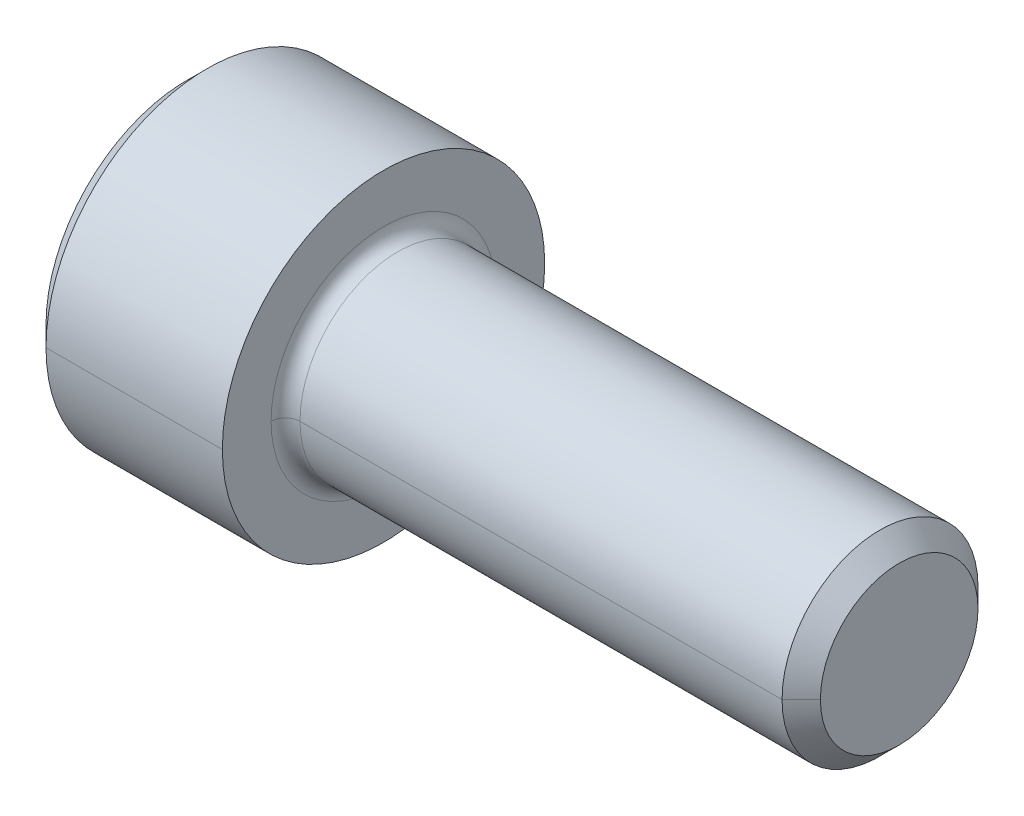
ISO-10303-21;
HEADER;
FILE_DESCRIPTION(('STEP AP214'),'2;1');
FILE_NAME('part.step','',(''),(''),'','','');
FILE_SCHEMA(('AUTOMOTIVE_DESIGN { 1 0 10303 214 1 1 1 1 }'));
ENDSEC;
DATA;
#1=APPLICATION_CONTEXT('core data for automotive mechanical design processes');
#2=APPLICATION_PROTOCOL_DEFINITION('international standard','automotive_design',2000,#1);
#3=PRODUCT_CONTEXT('',#1,'mechanical');
#4=PRODUCT('Part','Part','',(#3));
#5=PRODUCT_RELATED_PRODUCT_CATEGORY('part','',(#4));
#6=PRODUCT_DEFINITION_FORMATION('','',#4);
#7=PRODUCT_DEFINITION_CONTEXT('part definition',#1,'design');
#8=PRODUCT_DEFINITION('design','',#6,#7);
#9=PRODUCT_DEFINITION_SHAPE('','',#8);
#10=(LENGTH_UNIT() NAMED_UNIT(*) SI_UNIT(.MILLI.,.METRE.));
#11=(NAMED_UNIT(*) PLANE_ANGLE_UNIT() SI_UNIT($,.RADIAN.));
#12=(NAMED_UNIT(*) SI_UNIT($,.STERADIAN.) SOLID_ANGLE_UNIT());
#13=UNCERTAINTY_MEASURE_WITH_UNIT(LENGTH_MEASURE(1.E-05),#10,'distance_accuracy_value','');
#14=(GEOMETRIC_REPRESENTATION_CONTEXT(3) GLOBAL_UNCERTAINTY_ASSIGNED_CONTEXT((#13)) GLOBAL_UNIT_ASSIGNED_CONTEXT((#10,
#11,#12)) REPRESENTATION_CONTEXT('',''));
#15=CARTESIAN_POINT('',(0.,0.,0.));
#16=DIRECTION('',(0.,0.,1.));
#17=DIRECTION('',(1.,0.,0.));
#18=AXIS2_PLACEMENT_3D('',#15,#16,#17);
#19=CARTESIAN_POINT('',(2.286,0.,0.));
#20=DIRECTION('',(-1.,0.,0.));
#21=DIRECTION('',(0.,0.,1.));
#22=AXIS2_PLACEMENT_3D('',#19,#20,#21);
#23=CONICAL_SURFACE('',#22,1.98501,1.0471975511966);
#24=DIRECTION('',(-0.5,0.,-0.866025403784437));
#25=VECTOR('',#24,1.);
#26=CARTESIAN_POINT('',(2.286,0.,-1.98501));
#27=LINE('',#26,#25);
#28=CARTESIAN_POINT('',(3.43204605784411,0.,0.));
#29=VERTEX_POINT('',#28);
#30=CARTESIAN_POINT('',(2.286,0.,-1.98501));
#31=VERTEX_POINT('',#30);
#32=EDGE_CURVE('E293',#29,#31,#27,.T.);
#33=ORIENTED_EDGE('',*,*,#32,.F.);
#34=DIRECTION('',(-0.5,0.,0.866025403784437));
#35=VECTOR('',#34,1.);
#36=CARTESIAN_POINT('',(2.286,0.,1.98501));
#37=LINE('',#36,#35);
#38=CARTESIAN_POINT('',(2.286,0.,1.98501));
#39=VERTEX_POINT('',#38);
#40=EDGE_CURVE('E298',#29,#39,#37,.T.);
#41=ORIENTED_EDGE('',*,*,#40,.T.);
#42=CARTESIAN_POINT('',(2.286,0.,0.));
#43=DIRECTION('',(-1.,0.,0.));
#44=DIRECTION('',(0.,0.,1.));
#45=AXIS2_PLACEMENT_3D('',#42,#43,#44);
#46=CIRCLE('',#45,1.98501);
#47=CARTESIAN_POINT('',(2.286,1.71906908676615,0.992505));
#48=VERTEX_POINT('',#47);
#49=EDGE_CURVE('E11',#39,#48,#46,.T.);
#50=ORIENTED_EDGE('',*,*,#49,.T.);
#51=CARTESIAN_POINT('',(2.286,0.,0.));
#52=DIRECTION('',(-1.,0.,0.));
#53=DIRECTION('',(0.,0.,1.));
#54=AXIS2_PLACEMENT_3D('',#51,#52,#53);
#55=CIRCLE('',#54,1.98501);
#56=CARTESIAN_POINT('',(2.286,1.71906908676615,-0.992505));
#57=VERTEX_POINT('',#56);
#58=EDGE_CURVE('E28',#48,#57,#55,.T.);
#59=ORIENTED_EDGE('',*,*,#58,.T.);
#60=CARTESIAN_POINT('',(2.286,0.,0.));
#61=DIRECTION('',(-1.,0.,0.));
#62=DIRECTION('',(0.,0.,1.));
#63=AXIS2_PLACEMENT_3D('',#60,#61,#62);
#64=CIRCLE('',#63,1.98501);
#65=EDGE_CURVE('E337',#57,#31,#64,.T.);
#66=ORIENTED_EDGE('',*,*,#65,.T.);
#67=EDGE_LOOP('',(#33,#41,#50,#59,#66));
#68=FACE_BOUND('',#67,.T.);
#69=ADVANCED_FACE('F17',(#68),#23,.F.);
#70=CARTESIAN_POINT('',(2.286,1.14604605784411,1.98501));
#71=DIRECTION('',(-1.,0.,0.));
#72=DIRECTION('',(0.,0.,1.));
#73=AXIS2_PLACEMENT_3D('',#70,#71,#72);
#74=PLANE('',#73);
#75=ORIENTED_EDGE('',*,*,#49,.F.);
#76=DIRECTION('',(0.,1.,0.));
#77=VECTOR('',#76,1.);
#78=CARTESIAN_POINT('',(2.286,-1.14604605784409,1.98501));
#79=LINE('',#78,#77);
#80=CARTESIAN_POINT('',(2.286,1.14604605784411,1.98501));
#81=VERTEX_POINT('',#80);
#82=EDGE_CURVE('E253',#39,#81,#79,.T.);
#83=ORIENTED_EDGE('',*,*,#82,.T.);
#84=DIRECTION('',(0.,-0.5,0.86602540378444));
#85=VECTOR('',#84,1.);
#86=CARTESIAN_POINT('',(2.286,2.29209211568821,0.));
#87=LINE('',#86,#85);
#88=EDGE_CURVE('E254',#48,#81,#87,.T.);
#89=ORIENTED_EDGE('',*,*,#88,.F.);
#90=EDGE_LOOP('',(#75,#83,#89));
#91=FACE_BOUND('',#90,.T.);
#92=ADVANCED_FACE('F439',(#91),#74,.T.);
#93=CARTESIAN_POINT('',(2.286,1.14604605784411,1.98501));
#94=DIRECTION('',(-1.,0.,0.));
#95=DIRECTION('',(0.,0.,1.));
#96=AXIS2_PLACEMENT_3D('',#93,#94,#95);
#97=PLANE('',#96);
#98=ORIENTED_EDGE('',*,*,#58,.F.);
#99=DIRECTION('',(0.,-0.5,0.86602540378444));
#100=VECTOR('',#99,1.);
#101=CARTESIAN_POINT('',(2.286,2.29209211568821,0.));
#102=LINE('',#101,#100);
#103=CARTESIAN_POINT('',(2.286,2.29209211568821,0.));
#104=VERTEX_POINT('',#103);
#105=EDGE_CURVE('E192',#104,#48,#102,.T.);
#106=ORIENTED_EDGE('',*,*,#105,.F.);
#107=DIRECTION('',(0.,-0.5,-0.866025403784438));
#108=VECTOR('',#107,1.);
#109=CARTESIAN_POINT('',(2.286,2.29209211568821,0.));
#110=LINE('',#109,#108);
#111=EDGE_CURVE('E186',#104,#57,#110,.T.);
#112=ORIENTED_EDGE('',*,*,#111,.T.);
#113=EDGE_LOOP('',(#98,#106,#112));
#114=FACE_BOUND('',#113,.T.);
#115=ADVANCED_FACE('F444',(#114),#97,.T.);
#116=CARTESIAN_POINT('',(2.286,1.14604605784411,1.98501));
#117=DIRECTION('',(-1.,0.,0.));
#118=DIRECTION('',(0.,0.,1.));
#119=AXIS2_PLACEMENT_3D('',#116,#117,#118);
#120=PLANE('',#119);
#121=ORIENTED_EDGE('',*,*,#65,.F.);
#122=DIRECTION('',(0.,-0.5,-0.866025403784438));
#123=VECTOR('',#122,1.);
#124=CARTESIAN_POINT('',(2.286,2.29209211568821,0.));
#125=LINE('',#124,#123);
#126=CARTESIAN_POINT('',(2.286,1.1460460578441,-1.98501));
#127=VERTEX_POINT('',#126);
#128=EDGE_CURVE('E236',#57,#127,#125,.T.);
#129=ORIENTED_EDGE('',*,*,#128,.T.);
#130=DIRECTION('',(0.,-1.,0.));
#131=VECTOR('',#130,1.);
#132=CARTESIAN_POINT('',(2.286,1.1460460578441,-1.98501));
#133=LINE('',#132,#131);
#134=EDGE_CURVE('E279',#127,#31,#133,.T.);
#135=ORIENTED_EDGE('',*,*,#134,.T.);
#136=EDGE_LOOP('',(#121,#129,#135));
#137=FACE_BOUND('',#136,.T.);
#138=ADVANCED_FACE('F453',(#137),#120,.T.);
#139=CARTESIAN_POINT('',(2.286,1.14604605784411,1.98501));
#140=DIRECTION('',(-1.,0.,0.));
#141=DIRECTION('',(0.,0.,1.));
#142=AXIS2_PLACEMENT_3D('',#139,#140,#141);
#143=PLANE('',#142);
#144=CARTESIAN_POINT('',(2.286,0.,0.));
#145=DIRECTION('',(-1.,0.,0.));
#146=DIRECTION('',(0.,0.,1.));
#147=AXIS2_PLACEMENT_3D('',#144,#145,#146);
#148=CIRCLE('',#147,1.98501);
#149=CARTESIAN_POINT('',(2.286,-1.71906908676615,-0.992505));
#150=VERTEX_POINT('',#149);
#151=EDGE_CURVE('E297',#31,#150,#148,.T.);
#152=ORIENTED_EDGE('',*,*,#151,.F.);
#153=DIRECTION('',(0.,-1.,0.));
#154=VECTOR('',#153,1.);
#155=CARTESIAN_POINT('',(2.286,1.1460460578441,-1.98501));
#156=LINE('',#155,#154);
#157=CARTESIAN_POINT('',(2.286,-1.1460460578441,-1.98501));
#158=VERTEX_POINT('',#157);
#159=EDGE_CURVE('E283',#31,#158,#156,.T.);
#160=ORIENTED_EDGE('',*,*,#159,.T.);
#161=DIRECTION('',(0.,0.5,-0.86602540378444));
#162=VECTOR('',#161,1.);
#163=CARTESIAN_POINT('',(2.286,-2.2920921156882,0.));
#164=LINE('',#163,#162);
#165=EDGE_CURVE('E284',#150,#158,#164,.T.);
#166=ORIENTED_EDGE('',*,*,#165,.F.);
#167=EDGE_LOOP('',(#152,#160,#166));
#168=FACE_BOUND('',#167,.T.);
#169=ADVANCED_FACE('F458',(#168),#143,.T.);
#170=CARTESIAN_POINT('',(2.286,1.14604605784411,1.98501));
#171=DIRECTION('',(-1.,0.,0.));
#172=DIRECTION('',(0.,0.,1.));
#173=AXIS2_PLACEMENT_3D('',#170,#171,#172);
#174=PLANE('',#173);
#175=CARTESIAN_POINT('',(2.286,0.,0.));
#176=DIRECTION('',(-1.,0.,0.));
#177=DIRECTION('',(0.,0.,1.));
#178=AXIS2_PLACEMENT_3D('',#175,#176,#177);
#179=CIRCLE('',#178,1.98501);
#180=CARTESIAN_POINT('',(2.286,-1.71906908676614,0.992505));
#181=VERTEX_POINT('',#180);
#182=EDGE_CURVE('E304',#150,#181,#179,.T.);
#183=ORIENTED_EDGE('',*,*,#182,.F.);
#184=DIRECTION('',(0.,0.5,-0.86602540378444));
#185=VECTOR('',#184,1.);
#186=CARTESIAN_POINT('',(2.286,-2.2920921156882,0.));
#187=LINE('',#186,#185);
#188=CARTESIAN_POINT('',(2.286,-2.2920921156882,0.));
#189=VERTEX_POINT('',#188);
#190=EDGE_CURVE('E310',#189,#150,#187,.T.);
#191=ORIENTED_EDGE('',*,*,#190,.F.);
#192=DIRECTION('',(0.,-0.5,-0.866025403784438));
#193=VECTOR('',#192,1.);
#194=CARTESIAN_POINT('',(2.286,-1.14604605784409,1.98501));
#195=LINE('',#194,#193);
#196=EDGE_CURVE('E321',#181,#189,#195,.T.);
#197=ORIENTED_EDGE('',*,*,#196,.F.);
#198=EDGE_LOOP('',(#183,#191,#197));
#199=FACE_BOUND('',#198,.T.);
#200=ADVANCED_FACE('F603',(#199),#174,.T.);
#201=CARTESIAN_POINT('',(2.286,1.14604605784411,1.98501));
#202=DIRECTION('',(-1.,0.,0.));
#203=DIRECTION('',(0.,0.,1.));
#204=AXIS2_PLACEMENT_3D('',#201,#202,#203);
#205=PLANE('',#204);
#206=CARTESIAN_POINT('',(2.286,0.,0.));
#207=DIRECTION('',(-1.,0.,0.));
#208=DIRECTION('',(0.,0.,1.));
#209=AXIS2_PLACEMENT_3D('',#206,#207,#208);
#210=CIRCLE('',#209,1.98501);
#211=EDGE_CURVE('E21',#181,#39,#210,.T.);
#212=ORIENTED_EDGE('',*,*,#211,.F.);
#213=DIRECTION('',(0.,-0.5,-0.866025403784438));
#214=VECTOR('',#213,1.);
#215=CARTESIAN_POINT('',(2.286,-1.14604605784409,1.98501));
#216=LINE('',#215,#214);
#217=CARTESIAN_POINT('',(2.286,-1.14604605784409,1.98501));
#218=VERTEX_POINT('',#217);
#219=EDGE_CURVE('E308',#218,#181,#216,.T.);
#220=ORIENTED_EDGE('',*,*,#219,.F.);
#221=DIRECTION('',(0.,1.,0.));
#222=VECTOR('',#221,1.);
#223=CARTESIAN_POINT('',(2.286,-1.14604605784409,1.98501));
#224=LINE('',#223,#222);
#225=EDGE_CURVE('E309',#218,#39,#224,.T.);
#226=ORIENTED_EDGE('',*,*,#225,.T.);
#227=EDGE_LOOP('',(#212,#220,#226));
#228=FACE_BOUND('',#227,.T.);
#229=ADVANCED_FACE('F496',(#228),#205,.T.);
#230=CARTESIAN_POINT('',(2.286,2.29209211568821,0.));
#231=DIRECTION('',(0.,0.866025403784438,-0.5));
#232=DIRECTION('',(-1.,0.,0.));
#233=AXIS2_PLACEMENT_3D('',#230,#231,#232);
#234=PLANE('',#233);
#235=DIRECTION('',(0.,-0.5,-0.866025403784438));
#236=VECTOR('',#235,1.);
#237=CARTESIAN_POINT('',(0.,2.29209211568821,0.));
#238=LINE('',#237,#236);
#239=CARTESIAN_POINT('',(0.,2.29209211568821,0.));
#240=VERTEX_POINT('',#239);
#241=CARTESIAN_POINT('',(0.,1.1460460578441,-1.98501));
#242=VERTEX_POINT('',#241);
#243=EDGE_CURVE('E182',#240,#242,#238,.T.);
#244=ORIENTED_EDGE('',*,*,#243,.T.);
#245=DIRECTION('',(-1.,0.,0.));
#246=VECTOR('',#245,1.);
#247=CARTESIAN_POINT('',(2.286,1.1460460578441,-1.98501));
#248=LINE('',#247,#246);
#249=EDGE_CURVE('E239',#127,#242,#248,.T.);
#250=ORIENTED_EDGE('',*,*,#249,.F.);
#251=ORIENTED_EDGE('',*,*,#128,.F.);
#252=ORIENTED_EDGE('',*,*,#111,.F.);
#253=DIRECTION('',(-1.,0.,0.));
#254=VECTOR('',#253,1.);
#255=CARTESIAN_POINT('',(2.286,2.29209211568821,0.));
#256=LINE('',#255,#254);
#257=EDGE_CURVE('E178',#104,#240,#256,.T.);
#258=ORIENTED_EDGE('',*,*,#257,.T.);
#259=EDGE_LOOP('',(#244,#250,#251,#252,#258));
#260=FACE_BOUND('',#259,.T.);
#261=ADVANCED_FACE('F180',(#260),#234,.F.);
#262=CARTESIAN_POINT('',(2.286,1.1460460578441,-1.98501));
#263=DIRECTION('',(0.,0.,-1.));
#264=DIRECTION('',(0.,-1.,0.));
#265=AXIS2_PLACEMENT_3D('',#262,#263,#264);
#266=PLANE('',#265);
#267=DIRECTION('',(0.,-1.,0.));
#268=VECTOR('',#267,1.);
#269=CARTESIAN_POINT('',(0.,1.1460460578441,-1.98501));
#270=LINE('',#269,#268);
#271=CARTESIAN_POINT('',(0.,-1.1460460578441,-1.98501));
#272=VERTEX_POINT('',#271);
#273=EDGE_CURVE('E203',#242,#272,#270,.T.);
#274=ORIENTED_EDGE('',*,*,#273,.T.);
#275=DIRECTION('',(-1.,0.,0.));
#276=VECTOR('',#275,1.);
#277=CARTESIAN_POINT('',(2.286,-1.1460460578441,-1.98501));
#278=LINE('',#277,#276);
#279=EDGE_CURVE('E280',#158,#272,#278,.T.);
#280=ORIENTED_EDGE('',*,*,#279,.F.);
#281=ORIENTED_EDGE('',*,*,#159,.F.);
#282=ORIENTED_EDGE('',*,*,#134,.F.);
#283=ORIENTED_EDGE('',*,*,#249,.T.);
#284=EDGE_LOOP('',(#274,#280,#281,#282,#283));
#285=FACE_BOUND('',#284,.T.);
#286=ADVANCED_FACE('F476',(#285),#266,.F.);
#287=CARTESIAN_POINT('',(2.286,-2.2920921156882,0.));
#288=DIRECTION('',(0.,0.86602540378444,0.5));
#289=DIRECTION('',(1.,0.,0.));
#290=AXIS2_PLACEMENT_3D('',#287,#288,#289);
#291=PLANE('',#290);
#292=DIRECTION('',(0.,0.5,-0.86602540378444));
#293=VECTOR('',#292,1.);
#294=CARTESIAN_POINT('',(0.,-2.2920921156882,0.));
#295=LINE('',#294,#293);
#296=CARTESIAN_POINT('',(0.,-2.2920921156882,0.));
#297=VERTEX_POINT('',#296);
#298=EDGE_CURVE('E229',#297,#272,#295,.T.);
#299=ORIENTED_EDGE('',*,*,#298,.F.);
#300=DIRECTION('',(-1.,0.,0.));
#301=VECTOR('',#300,1.);
#302=CARTESIAN_POINT('',(2.286,-2.2920921156882,0.));
#303=LINE('',#302,#301);
#304=EDGE_CURVE('E314',#189,#297,#303,.T.);
#305=ORIENTED_EDGE('',*,*,#304,.F.);
#306=ORIENTED_EDGE('',*,*,#190,.T.);
#307=ORIENTED_EDGE('',*,*,#165,.T.);
#308=ORIENTED_EDGE('',*,*,#279,.T.);
#309=EDGE_LOOP('',(#299,#305,#306,#307,#308));
#310=FACE_BOUND('',#309,.T.);
#311=ADVANCED_FACE('F472',(#310),#291,.T.);
#312=CARTESIAN_POINT('',(2.286,-1.14604605784409,1.98501));
#313=DIRECTION('',(0.,0.866025403784438,-0.5));
#314=DIRECTION('',(-1.,0.,0.));
#315=AXIS2_PLACEMENT_3D('',#312,#313,#314);
#316=PLANE('',#315);
#317=DIRECTION('',(0.,-0.5,-0.866025403784438));
#318=VECTOR('',#317,1.);
#319=CARTESIAN_POINT('',(0.,-1.14604605784409,1.98501));
#320=LINE('',#319,#318);
#321=CARTESIAN_POINT('',(0.,-1.14604605784409,1.98501));
#322=VERTEX_POINT('',#321);
#323=EDGE_CURVE('E220',#322,#297,#320,.T.);
#324=ORIENTED_EDGE('',*,*,#323,.F.);
#325=DIRECTION('',(-1.,0.,0.));
#326=VECTOR('',#325,1.);
#327=CARTESIAN_POINT('',(2.286,-1.14604605784409,1.98501));
#328=LINE('',#327,#326);
#329=EDGE_CURVE('E305',#218,#322,#328,.T.);
#330=ORIENTED_EDGE('',*,*,#329,.F.);
#331=ORIENTED_EDGE('',*,*,#219,.T.);
#332=ORIENTED_EDGE('',*,*,#196,.T.);
#333=ORIENTED_EDGE('',*,*,#304,.T.);
#334=EDGE_LOOP('',(#324,#330,#331,#332,#333));
#335=FACE_BOUND('',#334,.T.);
#336=ADVANCED_FACE('F19',(#335),#316,.T.);
#337=CARTESIAN_POINT('',(2.286,-1.14604605784409,1.98501));
#338=DIRECTION('',(0.,0.,1.));
#339=DIRECTION('',(0.,-1.,0.));
#340=AXIS2_PLACEMENT_3D('',#337,#338,#339);
#341=PLANE('',#340);
#342=DIRECTION('',(0.,1.,0.));
#343=VECTOR('',#342,1.);
#344=CARTESIAN_POINT('',(0.,-1.14604605784409,1.98501));
#345=LINE('',#344,#343);
#346=CARTESIAN_POINT('',(0.,1.14604605784411,1.98501));
#347=VERTEX_POINT('',#346);
#348=EDGE_CURVE('E212',#322,#347,#345,.T.);
#349=ORIENTED_EDGE('',*,*,#348,.T.);
#350=DIRECTION('',(-1.,0.,0.));
#351=VECTOR('',#350,1.);
#352=CARTESIAN_POINT('',(2.286,1.14604605784411,1.98501));
#353=LINE('',#352,#351);
#354=EDGE_CURVE('E209',#81,#347,#353,.T.);
#355=ORIENTED_EDGE('',*,*,#354,.F.);
#356=ORIENTED_EDGE('',*,*,#82,.F.);
#357=ORIENTED_EDGE('',*,*,#225,.F.);
#358=ORIENTED_EDGE('',*,*,#329,.T.);
#359=EDGE_LOOP('',(#349,#355,#356,#357,#358));
#360=FACE_BOUND('',#359,.T.);
#361=ADVANCED_FACE('F451',(#360),#341,.F.);
#362=CARTESIAN_POINT('',(2.286,2.29209211568821,0.));
#363=DIRECTION('',(0.,-0.86602540378444,-0.5));
#364=DIRECTION('',(0.,0.5,-0.86602540378444));
#365=AXIS2_PLACEMENT_3D('',#362,#363,#364);
#366=PLANE('',#365);
#367=DIRECTION('',(0.,-0.5,0.86602540378444));
#368=VECTOR('',#367,1.);
#369=CARTESIAN_POINT('',(0.,2.29209211568821,0.));
#370=LINE('',#369,#368);
#371=EDGE_CURVE('E200',#240,#347,#370,.T.);
#372=ORIENTED_EDGE('',*,*,#371,.F.);
#373=ORIENTED_EDGE('',*,*,#257,.F.);
#374=ORIENTED_EDGE('',*,*,#105,.T.);
#375=ORIENTED_EDGE('',*,*,#88,.T.);
#376=ORIENTED_EDGE('',*,*,#354,.T.);
#377=EDGE_LOOP('',(#372,#373,#374,#375,#376));
#378=FACE_BOUND('',#377,.T.);
#379=ADVANCED_FACE('F206',(#378),#366,.T.);
#380=CARTESIAN_POINT('',(5.1816,0.,0.));
#381=DIRECTION('',(1.,0.,0.));
#382=DIRECTION('',(0.,0.,-1.));
#383=AXIS2_PLACEMENT_3D('',#380,#381,#382);
#384=TOROIDAL_SURFACE('',#383,2.7686,0.3556);
#385=CARTESIAN_POINT('',(5.1816,0.,2.7686));
#386=DIRECTION('',(0.,1.,0.));
#387=DIRECTION('',(0.,0.,1.));
#388=AXIS2_PLACEMENT_3D('',#385,#386,#387);
#389=CIRCLE('',#388,0.3556);
#390=CARTESIAN_POINT('',(5.1816,0.,2.413));
#391=VERTEX_POINT('',#390);
#392=CARTESIAN_POINT('',(4.826,0.,2.7686));
#393=VERTEX_POINT('',#392);
#394=EDGE_CURVE('E289',#391,#393,#389,.T.);
#395=ORIENTED_EDGE('',*,*,#394,.F.);
#396=CARTESIAN_POINT('',(5.1816,0.,0.));
#397=DIRECTION('',(1.,0.,0.));
#398=DIRECTION('',(0.,0.,-1.));
#399=AXIS2_PLACEMENT_3D('',#396,#397,#398);
#400=CIRCLE('',#399,2.413);
#401=CARTESIAN_POINT('',(5.1816,0.,-2.413));
#402=VERTEX_POINT('',#401);
#403=EDGE_CURVE('E234',#402,#391,#400,.T.);
#404=ORIENTED_EDGE('',*,*,#403,.F.);
#405=CARTESIAN_POINT('',(5.1816,0.,-2.7686));
#406=DIRECTION('',(0.,-1.,0.));
#407=DIRECTION('',(0.,0.,-1.));
#408=AXIS2_PLACEMENT_3D('',#405,#406,#407);
#409=CIRCLE('',#408,0.3556);
#410=CARTESIAN_POINT('',(4.826,0.,-2.7686));
#411=VERTEX_POINT('',#410);
#412=EDGE_CURVE('E258',#402,#411,#409,.T.);
#413=ORIENTED_EDGE('',*,*,#412,.T.);
#414=CARTESIAN_POINT('',(4.826,0.,0.));
#415=DIRECTION('',(-1.,0.,0.));
#416=DIRECTION('',(0.,0.,-1.));
#417=AXIS2_PLACEMENT_3D('',#414,#415,#416);
#418=CIRCLE('',#417,2.7686);
#419=EDGE_CURVE('E333',#393,#411,#418,.T.);
#420=ORIENTED_EDGE('',*,*,#419,.F.);
#421=EDGE_LOOP('',(#395,#404,#413,#420));
#422=FACE_BOUND('',#421,.T.);
#423=ADVANCED_FACE('F395',(#422),#384,.F.);
#424=CARTESIAN_POINT('',(17.526,1.94056,0.));
#425=DIRECTION('',(1.,0.,0.));
#426=DIRECTION('',(0.,1.,0.));
#427=AXIS2_PLACEMENT_3D('',#424,#425,#426);
#428=PLANE('',#427);
#429=CARTESIAN_POINT('',(17.526,0.,0.));
#430=DIRECTION('',(-1.,0.,0.));
#431=DIRECTION('',(0.,0.,1.));
#432=AXIS2_PLACEMENT_3D('',#429,#430,#431);
#433=CIRCLE('',#432,1.94056);
#434=CARTESIAN_POINT('',(17.526,0.,1.94056));
#435=VERTEX_POINT('',#434);
#436=CARTESIAN_POINT('',(17.526,0.,-1.94056));
#437=VERTEX_POINT('',#436);
#438=EDGE_CURVE('E262',#435,#437,#433,.T.);
#439=ORIENTED_EDGE('',*,*,#438,.F.);
#440=CARTESIAN_POINT('',(17.526,0.,0.));
#441=DIRECTION('',(-1.,0.,0.));
#442=DIRECTION('',(0.,0.,1.));
#443=AXIS2_PLACEMENT_3D('',#440,#441,#442);
#444=CIRCLE('',#443,1.94056);
#445=EDGE_CURVE('E193',#437,#435,#444,.T.);
#446=ORIENTED_EDGE('',*,*,#445,.F.);
#447=EDGE_LOOP('',(#439,#446));
#448=FACE_BOUND('',#447,.T.);
#449=ADVANCED_FACE('F382',(#448),#428,.T.);
#450=CARTESIAN_POINT('',(17.526,0.,0.));
#451=DIRECTION('',(-1.,0.,0.));
#452=DIRECTION('',(0.,0.,1.));
#453=AXIS2_PLACEMENT_3D('',#450,#451,#452);
#454=CONICAL_SURFACE('',#453,1.94056,0.785398163397401);
#455=DIRECTION('',(-0.707106781186581,0.,-0.707106781186514));
#456=VECTOR('',#455,1.);
#457=CARTESIAN_POINT('',(17.526,0.,-1.94056));
#458=LINE('',#457,#456);
#459=CARTESIAN_POINT('',(17.05356,0.,-2.41299999999997));
#460=VERTEX_POINT('',#459);
#461=EDGE_CURVE('E269',#437,#460,#458,.T.);
#462=ORIENTED_EDGE('',*,*,#461,.F.);
#463=ORIENTED_EDGE('',*,*,#445,.T.);
#464=DIRECTION('',(-0.707106781186581,0.,0.707106781186514));
#465=VECTOR('',#464,1.);
#466=CARTESIAN_POINT('',(17.526,0.,1.94056));
#467=LINE('',#466,#465);
#468=CARTESIAN_POINT('',(17.05356,0.,2.41299999999997));
#469=VERTEX_POINT('',#468);
#470=EDGE_CURVE('E235',#435,#469,#467,.T.);
#471=ORIENTED_EDGE('',*,*,#470,.T.);
#472=CARTESIAN_POINT('',(17.05356,0.,0.));
#473=DIRECTION('',(-1.,0.,0.));
#474=DIRECTION('',(0.,0.,1.));
#475=AXIS2_PLACEMENT_3D('',#472,#473,#474);
#476=CIRCLE('',#475,2.41299999999997);
#477=EDGE_CURVE('E330',#460,#469,#476,.T.);
#478=ORIENTED_EDGE('',*,*,#477,.F.);
#479=EDGE_LOOP('',(#462,#463,#471,#478));
#480=FACE_BOUND('',#479,.T.);
#481=ADVANCED_FACE('F384',(#480),#454,.T.);
#482=CARTESIAN_POINT('',(-31.75,0.,0.));
#483=DIRECTION('',(-1.,0.,0.));
#484=DIRECTION('',(0.,0.,1.));
#485=AXIS2_PLACEMENT_3D('',#482,#483,#484);
#486=CYLINDRICAL_SURFACE('',#485,2.413);
#487=DIRECTION('',(-1.,0.,0.));
#488=VECTOR('',#487,1.);
#489=CARTESIAN_POINT('',(-31.75,0.,-2.413));
#490=LINE('',#489,#488);
#491=EDGE_CURVE('E230',#460,#402,#490,.T.);
#492=ORIENTED_EDGE('',*,*,#491,.F.);
#493=ORIENTED_EDGE('',*,*,#477,.T.);
#494=DIRECTION('',(-1.,0.,0.));
#495=VECTOR('',#494,1.);
#496=CARTESIAN_POINT('',(-31.75,0.,2.413));
#497=LINE('',#496,#495);
#498=EDGE_CURVE('E273',#469,#391,#497,.T.);
#499=ORIENTED_EDGE('',*,*,#498,.T.);
#500=CARTESIAN_POINT('',(5.1816,0.,0.));
#501=DIRECTION('',(1.,0.,0.));
#502=DIRECTION('',(0.,0.,-1.));
#503=AXIS2_PLACEMENT_3D('',#500,#501,#502);
#504=CIRCLE('',#503,2.413);
#505=EDGE_CURVE('E285',#391,#402,#504,.T.);
#506=ORIENTED_EDGE('',*,*,#505,.T.);
#507=EDGE_LOOP('',(#492,#493,#499,#506));
#508=FACE_BOUND('',#507,.T.);
#509=ADVANCED_FACE('F388',(#508),#486,.T.);
#510=CARTESIAN_POINT('',(4.826,3.96875,0.));
#511=DIRECTION('',(1.,0.,0.));
#512=DIRECTION('',(0.,1.,0.));
#513=AXIS2_PLACEMENT_3D('',#510,#511,#512);
#514=PLANE('',#513);
#515=CARTESIAN_POINT('',(4.826,0.,0.));
#516=DIRECTION('',(-1.,0.,0.));
#517=DIRECTION('',(0.,0.,-1.));
#518=AXIS2_PLACEMENT_3D('',#515,#516,#517);
#519=CIRCLE('',#518,2.7686);
#520=EDGE_CURVE('E263',#411,#393,#519,.T.);
#521=ORIENTED_EDGE('',*,*,#520,.T.);
#522=ORIENTED_EDGE('',*,*,#419,.T.);
#523=EDGE_LOOP('',(#521,#522));
#524=FACE_BOUND('',#523,.T.);
#525=CARTESIAN_POINT('',(4.826,0.,0.));
#526=DIRECTION('',(-1.,0.,0.));
#527=DIRECTION('',(0.,0.,1.));
#528=AXIS2_PLACEMENT_3D('',#525,#526,#527);
#529=CIRCLE('',#528,3.96875);
#530=CARTESIAN_POINT('',(4.826,0.,3.96875));
#531=VERTEX_POINT('',#530);
#532=CARTESIAN_POINT('',(4.826,0.,-3.96875));
#533=VERTEX_POINT('',#532);
#534=EDGE_CURVE('E275',#531,#533,#529,.T.);
#535=ORIENTED_EDGE('',*,*,#534,.F.);
#536=CARTESIAN_POINT('',(4.826,0.,0.));
#537=DIRECTION('',(-1.,0.,0.));
#538=DIRECTION('',(0.,0.,1.));
#539=AXIS2_PLACEMENT_3D('',#536,#537,#538);
#540=CIRCLE('',#539,3.96875);
#541=EDGE_CURVE('E164',#533,#531,#540,.T.);
#542=ORIENTED_EDGE('',*,*,#541,.F.);
#543=EDGE_LOOP('',(#535,#542));
#544=FACE_BOUND('',#543,.T.);
#545=ADVANCED_FACE('F403',(#524,#544),#514,.T.);
#546=CARTESIAN_POINT('',(-31.75,0.,0.));
#547=DIRECTION('',(-1.,0.,0.));
#548=DIRECTION('',(0.,0.,1.));
#549=AXIS2_PLACEMENT_3D('',#546,#547,#548);
#550=CYLINDRICAL_SURFACE('',#549,3.96875);
#551=DIRECTION('',(-1.,0.,0.));
#552=VECTOR('',#551,1.);
#553=CARTESIAN_POINT('',(-31.75,0.,-3.96875));
#554=LINE('',#553,#552);
#555=CARTESIAN_POINT('',(0.4826,0.,-3.96875));
#556=VERTEX_POINT('',#555);
#557=EDGE_CURVE('E250',#533,#556,#554,.T.);
#558=ORIENTED_EDGE('',*,*,#557,.F.);
#559=ORIENTED_EDGE('',*,*,#541,.T.);
#560=DIRECTION('',(-1.,0.,0.));
#561=VECTOR('',#560,1.);
#562=CARTESIAN_POINT('',(-31.75,0.,3.96875));
#563=LINE('',#562,#561);
#564=CARTESIAN_POINT('',(0.4826,0.,3.96875));
#565=VERTEX_POINT('',#564);
#566=EDGE_CURVE('E245',#531,#565,#563,.T.);
#567=ORIENTED_EDGE('',*,*,#566,.T.);
#568=CARTESIAN_POINT('',(0.4826,0.,0.));
#569=DIRECTION('',(-1.,0.,0.));
#570=DIRECTION('',(0.,0.,1.));
#571=AXIS2_PLACEMENT_3D('',#568,#569,#570);
#572=CIRCLE('',#571,3.96875);
#573=EDGE_CURVE('E153',#556,#565,#572,.T.);
#574=ORIENTED_EDGE('',*,*,#573,.F.);
#575=EDGE_LOOP('',(#558,#559,#567,#574));
#576=FACE_BOUND('',#575,.T.);
#577=ADVANCED_FACE('F425',(#576),#550,.T.);
#578=CARTESIAN_POINT('',(0.,0.,0.));
#579=DIRECTION('',(1.,0.,0.));
#580=DIRECTION('',(0.,0.,-1.));
#581=AXIS2_PLACEMENT_3D('',#578,#579,#580);
#582=CONICAL_SURFACE('',#581,3.48615,0.78539816339745);
#583=DIRECTION('',(0.707106781186546,0.,0.707106781186549));
#584=VECTOR('',#583,1.);
#585=CARTESIAN_POINT('',(0.,0.,3.48615));
#586=LINE('',#585,#584);
#587=CARTESIAN_POINT('',(0.,0.,3.48615));
#588=VERTEX_POINT('',#587);
#589=EDGE_CURVE('E244',#588,#565,#586,.T.);
#590=ORIENTED_EDGE('',*,*,#589,.F.);
#591=CARTESIAN_POINT('',(0.,0.,0.));
#592=DIRECTION('',(-1.,0.,0.));
#593=DIRECTION('',(0.,0.,1.));
#594=AXIS2_PLACEMENT_3D('',#591,#592,#593);
#595=CIRCLE('',#594,3.48615);
#596=CARTESIAN_POINT('',(0.,0.,-3.48615));
#597=VERTEX_POINT('',#596);
#598=EDGE_CURVE('E213',#597,#588,#595,.T.);
#599=ORIENTED_EDGE('',*,*,#598,.F.);
#600=DIRECTION('',(0.707106781186546,0.,-0.707106781186549));
#601=VECTOR('',#600,1.);
#602=CARTESIAN_POINT('',(0.,0.,-3.48615));
#603=LINE('',#602,#601);
#604=EDGE_CURVE('E223',#597,#556,#603,.T.);
#605=ORIENTED_EDGE('',*,*,#604,.T.);
#606=ORIENTED_EDGE('',*,*,#573,.T.);
#607=EDGE_LOOP('',(#590,#599,#605,#606));
#608=FACE_BOUND('',#607,.T.);
#609=ADVANCED_FACE('F433',(#608),#582,.T.);
#610=CARTESIAN_POINT('',(0.,0.,0.));
#611=DIRECTION('',(-1.,0.,0.));
#612=DIRECTION('',(0.,0.,1.));
#613=AXIS2_PLACEMENT_3D('',#610,#611,#612);
#614=PLANE('',#613);
#615=ORIENTED_EDGE('',*,*,#371,.T.);
#616=ORIENTED_EDGE('',*,*,#348,.F.);
#617=ORIENTED_EDGE('',*,*,#323,.T.);
#618=ORIENTED_EDGE('',*,*,#298,.T.);
#619=ORIENTED_EDGE('',*,*,#273,.F.);
#620=ORIENTED_EDGE('',*,*,#243,.F.);
#621=EDGE_LOOP('',(#615,#616,#617,#618,#619,#620));
#622=FACE_BOUND('',#621,.T.);
#623=ORIENTED_EDGE('',*,*,#598,.T.);
#624=CARTESIAN_POINT('',(0.,0.,0.));
#625=DIRECTION('',(-1.,0.,0.));
#626=DIRECTION('',(0.,0.,1.));
#627=AXIS2_PLACEMENT_3D('',#624,#625,#626);
#628=CIRCLE('',#627,3.48615);
#629=EDGE_CURVE('E240',#588,#597,#628,.T.);
#630=ORIENTED_EDGE('',*,*,#629,.T.);
#631=EDGE_LOOP('',(#623,#630));
#632=FACE_BOUND('',#631,.T.);
#633=ADVANCED_FACE('F197',(#622,#632),#614,.T.);
#634=CARTESIAN_POINT('',(0.,0.,0.));
#635=DIRECTION('',(1.,0.,0.));
#636=DIRECTION('',(0.,0.,-1.));
#637=AXIS2_PLACEMENT_3D('',#634,#635,#636);
#638=CONICAL_SURFACE('',#637,3.48615,0.78539816339745);
#639=ORIENTED_EDGE('',*,*,#629,.F.);
#640=ORIENTED_EDGE('',*,*,#589,.T.);
#641=CARTESIAN_POINT('',(0.4826,0.,0.));
#642=DIRECTION('',(-1.,0.,0.));
#643=DIRECTION('',(0.,0.,1.));
#644=AXIS2_PLACEMENT_3D('',#641,#642,#643);
#645=CIRCLE('',#644,3.96875);
#646=EDGE_CURVE('E246',#565,#556,#645,.T.);
#647=ORIENTED_EDGE('',*,*,#646,.T.);
#648=ORIENTED_EDGE('',*,*,#604,.F.);
#649=EDGE_LOOP('',(#639,#640,#647,#648));
#650=FACE_BOUND('',#649,.T.);
#651=ADVANCED_FACE('F506',(#650),#638,.T.);
#652=CARTESIAN_POINT('',(-31.75,0.,0.));
#653=DIRECTION('',(-1.,0.,0.));
#654=DIRECTION('',(0.,0.,1.));
#655=AXIS2_PLACEMENT_3D('',#652,#653,#654);
#656=CYLINDRICAL_SURFACE('',#655,3.96875);
#657=ORIENTED_EDGE('',*,*,#534,.T.);
#658=ORIENTED_EDGE('',*,*,#557,.T.);
#659=ORIENTED_EDGE('',*,*,#646,.F.);
#660=ORIENTED_EDGE('',*,*,#566,.F.);
#661=EDGE_LOOP('',(#657,#658,#659,#660));
#662=FACE_BOUND('',#661,.T.);
#663=ADVANCED_FACE('F423',(#662),#656,.T.);
#664=CARTESIAN_POINT('',(-31.75,0.,0.));
#665=DIRECTION('',(-1.,0.,0.));
#666=DIRECTION('',(0.,0.,1.));
#667=AXIS2_PLACEMENT_3D('',#664,#665,#666);
#668=CYLINDRICAL_SURFACE('',#667,2.413);
#669=CARTESIAN_POINT('',(17.05356,0.,0.));
#670=DIRECTION('',(-1.,0.,0.));
#671=DIRECTION('',(0.,0.,1.));
#672=AXIS2_PLACEMENT_3D('',#669,#670,#671);
#673=CIRCLE('',#672,2.41299999999997);
#674=EDGE_CURVE('E266',#469,#460,#673,.T.);
#675=ORIENTED_EDGE('',*,*,#674,.T.);
#676=ORIENTED_EDGE('',*,*,#491,.T.);
#677=ORIENTED_EDGE('',*,*,#403,.T.);
#678=ORIENTED_EDGE('',*,*,#498,.F.);
#679=EDGE_LOOP('',(#675,#676,#677,#678));
#680=FACE_BOUND('',#679,.T.);
#681=ADVANCED_FACE('F392',(#680),#668,.T.);
#682=CARTESIAN_POINT('',(17.526,0.,0.));
#683=DIRECTION('',(-1.,0.,0.));
#684=DIRECTION('',(0.,0.,1.));
#685=AXIS2_PLACEMENT_3D('',#682,#683,#684);
#686=CONICAL_SURFACE('',#685,1.94056,0.785398163397401);
#687=ORIENTED_EDGE('',*,*,#438,.T.);
#688=ORIENTED_EDGE('',*,*,#461,.T.);
#689=ORIENTED_EDGE('',*,*,#674,.F.);
#690=ORIENTED_EDGE('',*,*,#470,.F.);
#691=EDGE_LOOP('',(#687,#688,#689,#690));
#692=FACE_BOUND('',#691,.T.);
#693=ADVANCED_FACE('F378',(#692),#686,.T.);
#694=CARTESIAN_POINT('',(5.1816,0.,0.));
#695=DIRECTION('',(1.,0.,0.));
#696=DIRECTION('',(0.,0.,-1.));
#697=AXIS2_PLACEMENT_3D('',#694,#695,#696);
#698=TOROIDAL_SURFACE('',#697,2.7686,0.3556);
#699=ORIENTED_EDGE('',*,*,#505,.F.);
#700=ORIENTED_EDGE('',*,*,#394,.T.);
#701=ORIENTED_EDGE('',*,*,#520,.F.);
#702=ORIENTED_EDGE('',*,*,#412,.F.);
#703=EDGE_LOOP('',(#699,#700,#701,#702));
#704=FACE_BOUND('',#703,.T.);
#705=ADVANCED_FACE('F399',(#704),#698,.F.);
#706=CARTESIAN_POINT('',(2.286,0.,0.));
#707=DIRECTION('',(-1.,0.,0.));
#708=DIRECTION('',(0.,0.,1.));
#709=AXIS2_PLACEMENT_3D('',#706,#707,#708);
#710=CONICAL_SURFACE('',#709,1.98501,1.0471975511966);
#711=ORIENTED_EDGE('',*,*,#40,.F.);
#712=ORIENTED_EDGE('',*,*,#32,.T.);
#713=ORIENTED_EDGE('',*,*,#151,.T.);
#714=ORIENTED_EDGE('',*,*,#182,.T.);
#715=ORIENTED_EDGE('',*,*,#211,.T.);
#716=EDGE_LOOP('',(#711,#712,#713,#714,#715));
#717=FACE_BOUND('',#716,.T.);
#718=ADVANCED_FACE('F480',(#717),#710,.F.);
#719=CLOSED_SHELL('',(#69,#92,#115,#138,#169,#200,#229,#261,#286,#311,#336,#361,#379,#423,#449,
#481,#509,#545,#577,#609,#633,#651,#663,#681,#693,#705,#718));
#720=MANIFOLD_SOLID_BREP('B1',#719);
#721=ADVANCED_BREP_SHAPE_REPRESENTATION('',(#18,#720),#14);
#722=SHAPE_DEFINITION_REPRESENTATION(#9,#721);
ENDSEC;
END-ISO-10303-21;
